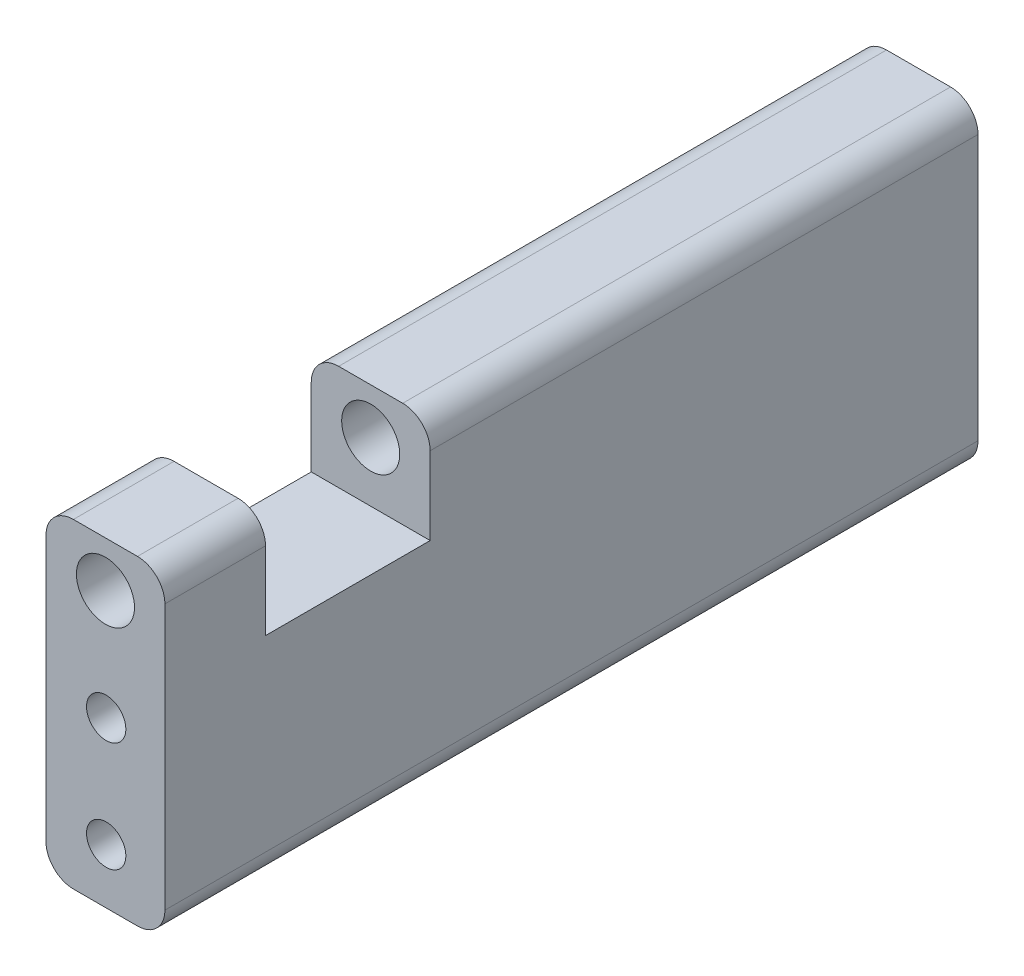
ISO-10303-21;
HEADER;
FILE_DESCRIPTION(('STEP AP214'),'2;1');
FILE_NAME('part.step','',(''),(''),'','','');
FILE_SCHEMA(('AUTOMOTIVE_DESIGN { 1 0 10303 214 1 1 1 1 }'));
ENDSEC;
DATA;
#1=APPLICATION_CONTEXT('core data for automotive mechanical design processes');
#2=APPLICATION_PROTOCOL_DEFINITION('international standard','automotive_design',2000,#1);
#3=PRODUCT_CONTEXT('',#1,'mechanical');
#4=PRODUCT('Part','Part','',(#3));
#5=PRODUCT_RELATED_PRODUCT_CATEGORY('part','',(#4));
#6=PRODUCT_DEFINITION_FORMATION('','',#4);
#7=PRODUCT_DEFINITION_CONTEXT('part definition',#1,'design');
#8=PRODUCT_DEFINITION('design','',#6,#7);
#9=PRODUCT_DEFINITION_SHAPE('','',#8);
#10=(LENGTH_UNIT() NAMED_UNIT(*) SI_UNIT(.MILLI.,.METRE.));
#11=(NAMED_UNIT(*) PLANE_ANGLE_UNIT() SI_UNIT($,.RADIAN.));
#12=(NAMED_UNIT(*) SI_UNIT($,.STERADIAN.) SOLID_ANGLE_UNIT());
#13=UNCERTAINTY_MEASURE_WITH_UNIT(LENGTH_MEASURE(1.E-05),#10,'distance_accuracy_value','');
#14=(GEOMETRIC_REPRESENTATION_CONTEXT(3) GLOBAL_UNCERTAINTY_ASSIGNED_CONTEXT((#13)) GLOBAL_UNIT_ASSIGNED_CONTEXT((#10,
#11,#12)) REPRESENTATION_CONTEXT('',''));
#15=CARTESIAN_POINT('',(0.,0.,0.));
#16=DIRECTION('',(0.,0.,1.));
#17=DIRECTION('',(1.,0.,0.));
#18=AXIS2_PLACEMENT_3D('',#15,#16,#17);
#19=CARTESIAN_POINT('',(0.,35.,88.9));
#20=DIRECTION('',(0.,-1.,0.));
#21=DIRECTION('',(0.,0.,-1.));
#22=AXIS2_PLACEMENT_3D('',#19,#20,#21);
#23=PLANE('',#22);
#24=DIRECTION('',(-1.,0.,0.));
#25=VECTOR('',#24,1.);
#26=CARTESIAN_POINT('',(0.,35.,77.9));
#27=LINE('',#26,#25);
#28=CARTESIAN_POINT('',(9.99999999999999,35.,77.9));
#29=VERTEX_POINT('',#28);
#30=CARTESIAN_POINT('',(3.,35.,77.9));
#31=VERTEX_POINT('',#30);
#32=EDGE_CURVE('E213',#29,#31,#27,.T.);
#33=ORIENTED_EDGE('',*,*,#32,.T.);
#34=DIRECTION('',(0.,0.,-1.));
#35=VECTOR('',#34,1.);
#36=CARTESIAN_POINT('',(3.,35.,88.9));
#37=LINE('',#36,#35);
#38=CARTESIAN_POINT('',(3.,35.,88.9));
#39=VERTEX_POINT('',#38);
#40=EDGE_CURVE('E338',#31,#39,#37,.F.);
#41=ORIENTED_EDGE('',*,*,#40,.T.);
#42=DIRECTION('',(-1.,0.,0.));
#43=VECTOR('',#42,1.);
#44=CARTESIAN_POINT('',(0.,35.,88.9));
#45=LINE('',#44,#43);
#46=CARTESIAN_POINT('',(9.99999999999999,35.,88.9));
#47=VERTEX_POINT('',#46);
#48=EDGE_CURVE('E254',#47,#39,#45,.T.);
#49=ORIENTED_EDGE('',*,*,#48,.F.);
#50=DIRECTION('',(0.,0.,-1.));
#51=VECTOR('',#50,1.);
#52=CARTESIAN_POINT('',(10.,35.,88.9));
#53=LINE('',#52,#51);
#54=EDGE_CURVE('E334',#47,#29,#53,.T.);
#55=ORIENTED_EDGE('',*,*,#54,.T.);
#56=EDGE_LOOP('',(#33,#41,#49,#55));
#57=FACE_BOUND('',#56,.T.);
#58=ADVANCED_FACE('F40',(#57),#23,.F.);
#59=CARTESIAN_POINT('',(6.5,30.,88.9));
#60=DIRECTION('',(0.,0.,-1.));
#61=DIRECTION('',(-1.,0.,0.));
#62=AXIS2_PLACEMENT_3D('',#59,#60,#61);
#63=CYLINDRICAL_SURFACE('',#62,3.175);
#64=CARTESIAN_POINT('',(6.5,30.,88.9));
#65=DIRECTION('',(0.,0.,1.));
#66=DIRECTION('',(1.,0.,0.));
#67=AXIS2_PLACEMENT_3D('',#64,#65,#66);
#68=CIRCLE('',#67,3.175);
#69=CARTESIAN_POINT('',(9.675,30.,88.9));
#70=VERTEX_POINT('',#69);
#71=EDGE_CURVE('E231',#70,#70,#68,.T.);
#72=ORIENTED_EDGE('',*,*,#71,.T.);
#73=EDGE_LOOP('',(#72));
#74=FACE_BOUND('',#73,.T.);
#75=CARTESIAN_POINT('',(6.5,30.,77.9));
#76=DIRECTION('',(0.,0.,-1.));
#77=DIRECTION('',(-1.,0.,0.));
#78=AXIS2_PLACEMENT_3D('',#75,#76,#77);
#79=CIRCLE('',#78,3.175);
#80=CARTESIAN_POINT('',(3.325,30.,77.9));
#81=VERTEX_POINT('',#80);
#82=EDGE_CURVE('E227',#81,#81,#79,.T.);
#83=ORIENTED_EDGE('',*,*,#82,.T.);
#84=EDGE_LOOP('',(#83));
#85=FACE_BOUND('',#84,.T.);
#86=ADVANCED_FACE('F383',(#74,#85),#63,.F.);
#87=CARTESIAN_POINT('',(0.,0.,88.9));
#88=DIRECTION('',(0.,0.,-1.));
#89=DIRECTION('',(-1.,0.,0.));
#90=AXIS2_PLACEMENT_3D('',#87,#88,#89);
#91=PLANE('',#90);
#92=CARTESIAN_POINT('',(6.57924630166814,18.,88.9));
#93=DIRECTION('',(0.,0.,1.));
#94=DIRECTION('',(1.,0.,0.));
#95=AXIS2_PLACEMENT_3D('',#92,#93,#94);
#96=CIRCLE('',#95,2.14999999999999);
#97=CARTESIAN_POINT('',(8.72924630166813,18.,88.9));
#98=VERTEX_POINT('',#97);
#99=EDGE_CURVE('E164',#98,#98,#96,.T.);
#100=ORIENTED_EDGE('',*,*,#99,.F.);
#101=EDGE_LOOP('',(#100));
#102=FACE_BOUND('',#101,.T.);
#103=CARTESIAN_POINT('',(6.57924630166814,6.,88.9));
#104=DIRECTION('',(0.,0.,1.));
#105=DIRECTION('',(1.,0.,0.));
#106=AXIS2_PLACEMENT_3D('',#103,#104,#105);
#107=CIRCLE('',#106,2.14999999999999);
#108=CARTESIAN_POINT('',(8.72924630166813,6.,88.9));
#109=VERTEX_POINT('',#108);
#110=EDGE_CURVE('E163',#109,#109,#107,.T.);
#111=ORIENTED_EDGE('',*,*,#110,.F.);
#112=EDGE_LOOP('',(#111));
#113=FACE_BOUND('',#112,.T.);
#114=DIRECTION('',(0.,-1.,0.));
#115=VECTOR('',#114,1.);
#116=CARTESIAN_POINT('',(0.,0.,88.9));
#117=LINE('',#116,#115);
#118=CARTESIAN_POINT('',(0.,32.,88.9));
#119=VERTEX_POINT('',#118);
#120=CARTESIAN_POINT('',(0.,3.,88.9));
#121=VERTEX_POINT('',#120);
#122=EDGE_CURVE('E241',#119,#121,#117,.T.);
#123=ORIENTED_EDGE('',*,*,#122,.T.);
#124=CARTESIAN_POINT('',(3.,3.,88.9));
#125=DIRECTION('',(0.,0.,-1.));
#126=DIRECTION('',(-1.,0.,0.));
#127=AXIS2_PLACEMENT_3D('',#124,#125,#126);
#128=CIRCLE('',#127,3.);
#129=CARTESIAN_POINT('',(3.,0.,88.9));
#130=VERTEX_POINT('',#129);
#131=EDGE_CURVE('E315',#121,#130,#128,.F.);
#132=ORIENTED_EDGE('',*,*,#131,.T.);
#133=DIRECTION('',(1.,0.,0.));
#134=VECTOR('',#133,1.);
#135=CARTESIAN_POINT('',(0.,0.,88.9));
#136=LINE('',#135,#134);
#137=CARTESIAN_POINT('',(9.99999999999999,0.,88.9));
#138=VERTEX_POINT('',#137);
#139=EDGE_CURVE('E245',#130,#138,#136,.T.);
#140=ORIENTED_EDGE('',*,*,#139,.T.);
#141=CARTESIAN_POINT('',(10.,3.,88.9));
#142=DIRECTION('',(0.,0.,-1.));
#143=DIRECTION('',(-1.,0.,0.));
#144=AXIS2_PLACEMENT_3D('',#141,#142,#143);
#145=CIRCLE('',#144,3.);
#146=CARTESIAN_POINT('',(13.,3.,88.9));
#147=VERTEX_POINT('',#146);
#148=EDGE_CURVE('E312',#138,#147,#145,.F.);
#149=ORIENTED_EDGE('',*,*,#148,.T.);
#150=DIRECTION('',(0.,1.,0.));
#151=VECTOR('',#150,1.);
#152=CARTESIAN_POINT('',(13.,0.,88.9));
#153=LINE('',#152,#151);
#154=CARTESIAN_POINT('',(13.,32.,88.9));
#155=VERTEX_POINT('',#154);
#156=EDGE_CURVE('E250',#147,#155,#153,.T.);
#157=ORIENTED_EDGE('',*,*,#156,.T.);
#158=CARTESIAN_POINT('',(10.,32.,88.9));
#159=DIRECTION('',(0.,0.,-1.));
#160=DIRECTION('',(-1.,0.,0.));
#161=AXIS2_PLACEMENT_3D('',#158,#159,#160);
#162=CIRCLE('',#161,3.);
#163=EDGE_CURVE('E306',#155,#47,#162,.F.);
#164=ORIENTED_EDGE('',*,*,#163,.T.);
#165=ORIENTED_EDGE('',*,*,#48,.T.);
#166=CARTESIAN_POINT('',(3.,32.,88.9));
#167=DIRECTION('',(0.,0.,-1.));
#168=DIRECTION('',(-1.,0.,0.));
#169=AXIS2_PLACEMENT_3D('',#166,#167,#168);
#170=CIRCLE('',#169,3.);
#171=EDGE_CURVE('E309',#39,#119,#170,.F.);
#172=ORIENTED_EDGE('',*,*,#171,.T.);
#173=EDGE_LOOP('',(#123,#132,#140,#149,#157,#164,#165,#172));
#174=FACE_BOUND('',#173,.T.);
#175=ORIENTED_EDGE('',*,*,#71,.F.);
#176=EDGE_LOOP('',(#175));
#177=FACE_BOUND('',#176,.T.);
#178=ADVANCED_FACE('F389',(#102,#113,#174,#177),#91,.F.);
#179=CARTESIAN_POINT('',(0.,0.,0.));
#180=DIRECTION('',(0.,0.,-1.));
#181=DIRECTION('',(-1.,0.,0.));
#182=AXIS2_PLACEMENT_3D('',#179,#180,#181);
#183=PLANE('',#182);
#184=CARTESIAN_POINT('',(6.57924630166814,18.,0.));
#185=DIRECTION('',(0.,0.,-1.));
#186=DIRECTION('',(-1.,0.,0.));
#187=AXIS2_PLACEMENT_3D('',#184,#185,#186);
#188=CIRCLE('',#187,2.14999999999999);
#189=CARTESIAN_POINT('',(4.42924630166815,18.,0.));
#190=VERTEX_POINT('',#189);
#191=EDGE_CURVE('E179',#190,#190,#188,.T.);
#192=ORIENTED_EDGE('',*,*,#191,.F.);
#193=EDGE_LOOP('',(#192));
#194=FACE_BOUND('',#193,.T.);
#195=CARTESIAN_POINT('',(6.57924630166814,6.,0.));
#196=DIRECTION('',(0.,0.,-1.));
#197=DIRECTION('',(-1.,0.,0.));
#198=AXIS2_PLACEMENT_3D('',#195,#196,#197);
#199=CIRCLE('',#198,2.14999999999999);
#200=CARTESIAN_POINT('',(4.42924630166815,6.,0.));
#201=VERTEX_POINT('',#200);
#202=EDGE_CURVE('E186',#201,#201,#199,.T.);
#203=ORIENTED_EDGE('',*,*,#202,.F.);
#204=EDGE_LOOP('',(#203));
#205=FACE_BOUND('',#204,.T.);
#206=DIRECTION('',(1.,0.,0.));
#207=VECTOR('',#206,1.);
#208=CARTESIAN_POINT('',(0.,0.,0.));
#209=LINE('',#208,#207);
#210=CARTESIAN_POINT('',(3.,0.,0.));
#211=VERTEX_POINT('',#210);
#212=CARTESIAN_POINT('',(9.99999999999999,0.,0.));
#213=VERTEX_POINT('',#212);
#214=EDGE_CURVE('E262',#211,#213,#209,.T.);
#215=ORIENTED_EDGE('',*,*,#214,.F.);
#216=CARTESIAN_POINT('',(3.,3.,0.));
#217=DIRECTION('',(0.,0.,-1.));
#218=DIRECTION('',(-1.,0.,0.));
#219=AXIS2_PLACEMENT_3D('',#216,#217,#218);
#220=CIRCLE('',#219,3.);
#221=CARTESIAN_POINT('',(0.,3.,0.));
#222=VERTEX_POINT('',#221);
#223=EDGE_CURVE('E293',#211,#222,#220,.T.);
#224=ORIENTED_EDGE('',*,*,#223,.T.);
#225=DIRECTION('',(0.,-1.,0.));
#226=VECTOR('',#225,1.);
#227=CARTESIAN_POINT('',(0.,0.,0.));
#228=LINE('',#227,#226);
#229=CARTESIAN_POINT('',(0.,32.,0.));
#230=VERTEX_POINT('',#229);
#231=EDGE_CURVE('E235',#230,#222,#228,.T.);
#232=ORIENTED_EDGE('',*,*,#231,.F.);
#233=CARTESIAN_POINT('',(3.,32.,0.));
#234=DIRECTION('',(0.,0.,-1.));
#235=DIRECTION('',(-1.,0.,0.));
#236=AXIS2_PLACEMENT_3D('',#233,#234,#235);
#237=CIRCLE('',#236,3.);
#238=CARTESIAN_POINT('',(3.,35.,0.));
#239=VERTEX_POINT('',#238);
#240=EDGE_CURVE('E287',#230,#239,#237,.T.);
#241=ORIENTED_EDGE('',*,*,#240,.T.);
#242=DIRECTION('',(-1.,0.,0.));
#243=VECTOR('',#242,1.);
#244=CARTESIAN_POINT('',(0.,35.,0.));
#245=LINE('',#244,#243);
#246=CARTESIAN_POINT('',(9.99999999999999,35.,0.));
#247=VERTEX_POINT('',#246);
#248=EDGE_CURVE('E246',#247,#239,#245,.T.);
#249=ORIENTED_EDGE('',*,*,#248,.F.);
#250=CARTESIAN_POINT('',(10.,32.,0.));
#251=DIRECTION('',(0.,0.,-1.));
#252=DIRECTION('',(-1.,0.,0.));
#253=AXIS2_PLACEMENT_3D('',#250,#251,#252);
#254=CIRCLE('',#253,3.);
#255=CARTESIAN_POINT('',(13.,32.,0.));
#256=VERTEX_POINT('',#255);
#257=EDGE_CURVE('E284',#247,#256,#254,.T.);
#258=ORIENTED_EDGE('',*,*,#257,.T.);
#259=DIRECTION('',(0.,1.,0.));
#260=VECTOR('',#259,1.);
#261=CARTESIAN_POINT('',(13.,0.,0.));
#262=LINE('',#261,#260);
#263=CARTESIAN_POINT('',(13.,3.,0.));
#264=VERTEX_POINT('',#263);
#265=EDGE_CURVE('E266',#264,#256,#262,.T.);
#266=ORIENTED_EDGE('',*,*,#265,.F.);
#267=CARTESIAN_POINT('',(10.,3.,0.));
#268=DIRECTION('',(0.,0.,-1.));
#269=DIRECTION('',(-1.,0.,0.));
#270=AXIS2_PLACEMENT_3D('',#267,#268,#269);
#271=CIRCLE('',#270,3.);
#272=EDGE_CURVE('E290',#264,#213,#271,.T.);
#273=ORIENTED_EDGE('',*,*,#272,.T.);
#274=EDGE_LOOP('',(#215,#224,#232,#241,#249,#258,#266,#273));
#275=FACE_BOUND('',#274,.T.);
#276=CARTESIAN_POINT('',(6.5,30.,0.));
#277=DIRECTION('',(0.,0.,1.));
#278=DIRECTION('',(1.,0.,0.));
#279=AXIS2_PLACEMENT_3D('',#276,#277,#278);
#280=CIRCLE('',#279,3.175);
#281=CARTESIAN_POINT('',(9.675,30.,0.));
#282=VERTEX_POINT('',#281);
#283=EDGE_CURVE('E236',#282,#282,#280,.T.);
#284=ORIENTED_EDGE('',*,*,#283,.T.);
#285=EDGE_LOOP('',(#284));
#286=FACE_BOUND('',#285,.T.);
#287=ADVANCED_FACE('F353',(#194,#205,#275,#286),#183,.T.);
#288=CARTESIAN_POINT('',(0.,0.,88.9));
#289=DIRECTION('',(1.,0.,0.));
#290=DIRECTION('',(0.,0.,-1.));
#291=AXIS2_PLACEMENT_3D('',#288,#289,#290);
#292=PLANE('',#291);
#293=ORIENTED_EDGE('',*,*,#231,.T.);
#294=DIRECTION('',(0.,0.,-1.));
#295=VECTOR('',#294,1.);
#296=CARTESIAN_POINT('',(0.,3.,88.9));
#297=LINE('',#296,#295);
#298=EDGE_CURVE('E303',#222,#121,#297,.F.);
#299=ORIENTED_EDGE('',*,*,#298,.T.);
#300=ORIENTED_EDGE('',*,*,#122,.F.);
#301=DIRECTION('',(0.,0.,-1.));
#302=VECTOR('',#301,1.);
#303=CARTESIAN_POINT('',(0.,32.,88.9));
#304=LINE('',#303,#302);
#305=CARTESIAN_POINT('',(0.,32.,77.9));
#306=VERTEX_POINT('',#305);
#307=EDGE_CURVE('E300',#119,#306,#304,.T.);
#308=ORIENTED_EDGE('',*,*,#307,.T.);
#309=DIRECTION('',(0.,-1.,0.));
#310=VECTOR('',#309,1.);
#311=CARTESIAN_POINT('',(0.,30.,77.9));
#312=LINE('',#311,#310);
#313=CARTESIAN_POINT('',(0.,23.5,77.9));
#314=VERTEX_POINT('',#313);
#315=EDGE_CURVE('E217',#306,#314,#312,.T.);
#316=ORIENTED_EDGE('',*,*,#315,.T.);
#317=DIRECTION('',(0.,0.,1.));
#318=VECTOR('',#317,1.);
#319=CARTESIAN_POINT('',(0.,23.5,59.9));
#320=LINE('',#319,#318);
#321=CARTESIAN_POINT('',(0.,23.5,59.9));
#322=VERTEX_POINT('',#321);
#323=EDGE_CURVE('E209',#322,#314,#320,.T.);
#324=ORIENTED_EDGE('',*,*,#323,.F.);
#325=DIRECTION('',(0.,-1.,0.));
#326=VECTOR('',#325,1.);
#327=CARTESIAN_POINT('',(0.,30.,59.9));
#328=LINE('',#327,#326);
#329=CARTESIAN_POINT('',(0.,32.,59.9));
#330=VERTEX_POINT('',#329);
#331=EDGE_CURVE('E202',#330,#322,#328,.T.);
#332=ORIENTED_EDGE('',*,*,#331,.F.);
#333=DIRECTION('',(0.,0.,-1.));
#334=VECTOR('',#333,1.);
#335=CARTESIAN_POINT('',(0.,32.,88.9));
#336=LINE('',#335,#334);
#337=EDGE_CURVE('E296',#330,#230,#336,.T.);
#338=ORIENTED_EDGE('',*,*,#337,.T.);
#339=EDGE_LOOP('',(#293,#299,#300,#308,#316,#324,#332,#338));
#340=FACE_BOUND('',#339,.T.);
#341=ADVANCED_FACE('F363',(#340),#292,.F.);
#342=CARTESIAN_POINT('',(0.,0.,88.9));
#343=DIRECTION('',(0.,1.,0.));
#344=DIRECTION('',(0.,0.,1.));
#345=AXIS2_PLACEMENT_3D('',#342,#343,#344);
#346=PLANE('',#345);
#347=ORIENTED_EDGE('',*,*,#139,.F.);
#348=DIRECTION('',(0.,0.,-1.));
#349=VECTOR('',#348,1.);
#350=CARTESIAN_POINT('',(3.,0.,88.9));
#351=LINE('',#350,#349);
#352=EDGE_CURVE('E280',#130,#211,#351,.T.);
#353=ORIENTED_EDGE('',*,*,#352,.T.);
#354=ORIENTED_EDGE('',*,*,#214,.T.);
#355=DIRECTION('',(0.,0.,-1.));
#356=VECTOR('',#355,1.);
#357=CARTESIAN_POINT('',(10.,0.,88.9));
#358=LINE('',#357,#356);
#359=EDGE_CURVE('E258',#213,#138,#358,.F.);
#360=ORIENTED_EDGE('',*,*,#359,.T.);
#361=EDGE_LOOP('',(#347,#353,#354,#360));
#362=FACE_BOUND('',#361,.T.);
#363=ADVANCED_FACE('F401',(#362),#346,.F.);
#364=CARTESIAN_POINT('',(13.,0.,88.9));
#365=DIRECTION('',(-1.,0.,0.));
#366=DIRECTION('',(0.,0.,1.));
#367=AXIS2_PLACEMENT_3D('',#364,#365,#366);
#368=PLANE('',#367);
#369=ORIENTED_EDGE('',*,*,#156,.F.);
#370=DIRECTION('',(0.,0.,-1.));
#371=VECTOR('',#370,1.);
#372=CARTESIAN_POINT('',(13.,3.,88.9));
#373=LINE('',#372,#371);
#374=EDGE_CURVE('E324',#147,#264,#373,.T.);
#375=ORIENTED_EDGE('',*,*,#374,.T.);
#376=ORIENTED_EDGE('',*,*,#265,.T.);
#377=DIRECTION('',(0.,0.,-1.));
#378=VECTOR('',#377,1.);
#379=CARTESIAN_POINT('',(13.,32.,88.9));
#380=LINE('',#379,#378);
#381=CARTESIAN_POINT('',(13.,32.,59.9));
#382=VERTEX_POINT('',#381);
#383=EDGE_CURVE('E318',#256,#382,#380,.F.);
#384=ORIENTED_EDGE('',*,*,#383,.T.);
#385=DIRECTION('',(0.,1.,0.));
#386=VECTOR('',#385,1.);
#387=CARTESIAN_POINT('',(13.,23.5,59.9));
#388=LINE('',#387,#386);
#389=CARTESIAN_POINT('',(13.,23.5,59.9));
#390=VERTEX_POINT('',#389);
#391=EDGE_CURVE('E195',#390,#382,#388,.T.);
#392=ORIENTED_EDGE('',*,*,#391,.F.);
#393=DIRECTION('',(0.,0.,1.));
#394=VECTOR('',#393,1.);
#395=CARTESIAN_POINT('',(13.,23.5,59.9));
#396=LINE('',#395,#394);
#397=CARTESIAN_POINT('',(13.,23.5,77.9));
#398=VERTEX_POINT('',#397);
#399=EDGE_CURVE('E223',#390,#398,#396,.T.);
#400=ORIENTED_EDGE('',*,*,#399,.T.);
#401=DIRECTION('',(0.,1.,0.));
#402=VECTOR('',#401,1.);
#403=CARTESIAN_POINT('',(13.,35.,77.9));
#404=LINE('',#403,#402);
#405=CARTESIAN_POINT('',(13.,32.,77.9));
#406=VERTEX_POINT('',#405);
#407=EDGE_CURVE('E194',#398,#406,#404,.T.);
#408=ORIENTED_EDGE('',*,*,#407,.T.);
#409=DIRECTION('',(0.,0.,-1.));
#410=VECTOR('',#409,1.);
#411=CARTESIAN_POINT('',(13.,32.,88.9));
#412=LINE('',#411,#410);
#413=EDGE_CURVE('E321',#406,#155,#412,.F.);
#414=ORIENTED_EDGE('',*,*,#413,.T.);
#415=EDGE_LOOP('',(#369,#375,#376,#384,#392,#400,#408,#414));
#416=FACE_BOUND('',#415,.T.);
#417=ADVANCED_FACE('F374',(#416),#368,.F.);
#418=ORIENTED_EDGE('',*,*,#248,.T.);
#419=DIRECTION('',(0.,0.,-1.));
#420=VECTOR('',#419,1.);
#421=CARTESIAN_POINT('',(3.,35.,88.9));
#422=LINE('',#421,#420);
#423=CARTESIAN_POINT('',(3.,35.,59.9));
#424=VERTEX_POINT('',#423);
#425=EDGE_CURVE('E56',#239,#424,#422,.F.);
#426=ORIENTED_EDGE('',*,*,#425,.T.);
#427=DIRECTION('',(-1.,0.,0.));
#428=VECTOR('',#427,1.);
#429=CARTESIAN_POINT('',(0.,35.,59.9));
#430=LINE('',#429,#428);
#431=CARTESIAN_POINT('',(9.99999999999999,35.,59.9));
#432=VERTEX_POINT('',#431);
#433=EDGE_CURVE('E198',#432,#424,#430,.T.);
#434=ORIENTED_EDGE('',*,*,#433,.F.);
#435=DIRECTION('',(0.,0.,-1.));
#436=VECTOR('',#435,1.);
#437=CARTESIAN_POINT('',(10.,35.,88.9));
#438=LINE('',#437,#436);
#439=EDGE_CURVE('E341',#432,#247,#438,.T.);
#440=ORIENTED_EDGE('',*,*,#439,.T.);
#441=EDGE_LOOP('',(#418,#426,#434,#440));
#442=FACE_BOUND('',#441,.T.);
#443=ADVANCED_FACE('F349',(#442),#23,.F.);
#444=CARTESIAN_POINT('',(6.5,30.,59.9));
#445=DIRECTION('',(0.,0.,-1.));
#446=DIRECTION('',(-1.,0.,0.));
#447=AXIS2_PLACEMENT_3D('',#444,#445,#446);
#448=CIRCLE('',#447,3.175);
#449=CARTESIAN_POINT('',(3.325,30.,59.9));
#450=VERTEX_POINT('',#449);
#451=EDGE_CURVE('E240',#450,#450,#448,.T.);
#452=ORIENTED_EDGE('',*,*,#451,.F.);
#453=EDGE_LOOP('',(#452));
#454=FACE_BOUND('',#453,.T.);
#455=ORIENTED_EDGE('',*,*,#283,.F.);
#456=EDGE_LOOP('',(#455));
#457=FACE_BOUND('',#456,.T.);
#458=ADVANCED_FACE('F392',(#454,#457),#63,.F.);
#459=CARTESIAN_POINT('',(0.,23.5,59.9));
#460=DIRECTION('',(0.,-1.,0.));
#461=DIRECTION('',(0.,0.,-1.));
#462=AXIS2_PLACEMENT_3D('',#459,#460,#461);
#463=PLANE('',#462);
#464=DIRECTION('',(1.,0.,0.));
#465=VECTOR('',#464,1.);
#466=CARTESIAN_POINT('',(0.,23.5,77.9));
#467=LINE('',#466,#465);
#468=EDGE_CURVE('E199',#314,#398,#467,.T.);
#469=ORIENTED_EDGE('',*,*,#468,.T.);
#470=ORIENTED_EDGE('',*,*,#399,.F.);
#471=DIRECTION('',(1.,0.,0.));
#472=VECTOR('',#471,1.);
#473=CARTESIAN_POINT('',(0.,23.5,59.9));
#474=LINE('',#473,#472);
#475=EDGE_CURVE('E205',#322,#390,#474,.T.);
#476=ORIENTED_EDGE('',*,*,#475,.F.);
#477=ORIENTED_EDGE('',*,*,#323,.T.);
#478=EDGE_LOOP('',(#469,#470,#476,#477));
#479=FACE_BOUND('',#478,.T.);
#480=ADVANCED_FACE('F370',(#479),#463,.F.);
#481=CARTESIAN_POINT('',(0.,0.,59.9));
#482=DIRECTION('',(0.,0.,-1.));
#483=DIRECTION('',(-1.,0.,0.));
#484=AXIS2_PLACEMENT_3D('',#481,#482,#483);
#485=PLANE('',#484);
#486=ORIENTED_EDGE('',*,*,#451,.T.);
#487=EDGE_LOOP('',(#486));
#488=FACE_BOUND('',#487,.T.);
#489=ORIENTED_EDGE('',*,*,#433,.T.);
#490=CARTESIAN_POINT('',(3.,32.,59.9));
#491=DIRECTION('',(0.,0.,-1.));
#492=DIRECTION('',(-1.,0.,0.));
#493=AXIS2_PLACEMENT_3D('',#490,#491,#492);
#494=CIRCLE('',#493,3.);
#495=EDGE_CURVE('E11',#424,#330,#494,.F.);
#496=ORIENTED_EDGE('',*,*,#495,.T.);
#497=ORIENTED_EDGE('',*,*,#331,.T.);
#498=ORIENTED_EDGE('',*,*,#475,.T.);
#499=ORIENTED_EDGE('',*,*,#391,.T.);
#500=CARTESIAN_POINT('',(10.,32.,59.9));
#501=DIRECTION('',(0.,0.,-1.));
#502=DIRECTION('',(-1.,0.,0.));
#503=AXIS2_PLACEMENT_3D('',#500,#501,#502);
#504=CIRCLE('',#503,3.);
#505=EDGE_CURVE('E49',#382,#432,#504,.F.);
#506=ORIENTED_EDGE('',*,*,#505,.T.);
#507=EDGE_LOOP('',(#489,#496,#497,#498,#499,#506));
#508=FACE_BOUND('',#507,.T.);
#509=ADVANCED_FACE('F367',(#488,#508),#485,.F.);
#510=CARTESIAN_POINT('',(0.,0.,77.9));
#511=DIRECTION('',(0.,0.,-1.));
#512=DIRECTION('',(-1.,0.,0.));
#513=AXIS2_PLACEMENT_3D('',#510,#511,#512);
#514=PLANE('',#513);
#515=ORIENTED_EDGE('',*,*,#82,.F.);
#516=EDGE_LOOP('',(#515));
#517=FACE_BOUND('',#516,.T.);
#518=ORIENTED_EDGE('',*,*,#315,.F.);
#519=CARTESIAN_POINT('',(3.,32.,77.9));
#520=DIRECTION('',(0.,0.,-1.));
#521=DIRECTION('',(-1.,0.,0.));
#522=AXIS2_PLACEMENT_3D('',#519,#520,#521);
#523=CIRCLE('',#522,3.);
#524=EDGE_CURVE('E331',#306,#31,#523,.T.);
#525=ORIENTED_EDGE('',*,*,#524,.T.);
#526=ORIENTED_EDGE('',*,*,#32,.F.);
#527=CARTESIAN_POINT('',(10.,32.,77.9));
#528=DIRECTION('',(0.,0.,-1.));
#529=DIRECTION('',(-1.,0.,0.));
#530=AXIS2_PLACEMENT_3D('',#527,#528,#529);
#531=CIRCLE('',#530,3.);
#532=EDGE_CURVE('E328',#29,#406,#531,.T.);
#533=ORIENTED_EDGE('',*,*,#532,.T.);
#534=ORIENTED_EDGE('',*,*,#407,.F.);
#535=ORIENTED_EDGE('',*,*,#468,.F.);
#536=EDGE_LOOP('',(#518,#525,#526,#533,#534,#535));
#537=FACE_BOUND('',#536,.T.);
#538=ADVANCED_FACE('F444',(#517,#537),#514,.T.);
#539=CARTESIAN_POINT('',(6.57924630166814,6.,5.));
#540=DIRECTION('',(0.,0.,-1.));
#541=DIRECTION('',(-1.,0.,0.));
#542=AXIS2_PLACEMENT_3D('',#539,#540,#541);
#543=CONICAL_SURFACE('',#542,2.14999999999999,1.02974425867665);
#544=CARTESIAN_POINT('',(6.57924630166814,6.,6.29185033090925));
#545=VERTEX_POINT('',#544);
#546=VERTEX_LOOP('',#545);
#547=FACE_BOUND('',#546,.T.);
#548=CARTESIAN_POINT('',(6.57924630166814,6.,5.));
#549=DIRECTION('',(0.,0.,-1.));
#550=DIRECTION('',(-1.,0.,0.));
#551=AXIS2_PLACEMENT_3D('',#548,#549,#550);
#552=CIRCLE('',#551,2.14999999999999);
#553=CARTESIAN_POINT('',(4.42924630166815,6.,5.));
#554=VERTEX_POINT('',#553);
#555=EDGE_CURVE('E190',#554,#554,#552,.T.);
#556=ORIENTED_EDGE('',*,*,#555,.T.);
#557=EDGE_LOOP('',(#556));
#558=FACE_BOUND('',#557,.T.);
#559=ADVANCED_FACE('F446',(#547,#558),#543,.F.);
#560=CARTESIAN_POINT('',(6.57924630166814,6.,0.));
#561=DIRECTION('',(0.,0.,-1.));
#562=DIRECTION('',(-1.,0.,0.));
#563=AXIS2_PLACEMENT_3D('',#560,#561,#562);
#564=CYLINDRICAL_SURFACE('',#563,2.14999999999999);
#565=ORIENTED_EDGE('',*,*,#555,.F.);
#566=EDGE_LOOP('',(#565));
#567=FACE_BOUND('',#566,.T.);
#568=ORIENTED_EDGE('',*,*,#202,.T.);
#569=EDGE_LOOP('',(#568));
#570=FACE_BOUND('',#569,.T.);
#571=ADVANCED_FACE('F453',(#567,#570),#564,.F.);
#572=CARTESIAN_POINT('',(6.57924630166814,18.,5.));
#573=DIRECTION('',(0.,0.,-1.));
#574=DIRECTION('',(-1.,0.,0.));
#575=AXIS2_PLACEMENT_3D('',#572,#573,#574);
#576=CONICAL_SURFACE('',#575,2.14999999999999,1.02974425867665);
#577=CARTESIAN_POINT('',(6.57924630166814,18.,6.29185033090925));
#578=VERTEX_POINT('',#577);
#579=VERTEX_LOOP('',#578);
#580=FACE_BOUND('',#579,.T.);
#581=CARTESIAN_POINT('',(6.57924630166814,18.,5.));
#582=DIRECTION('',(0.,0.,-1.));
#583=DIRECTION('',(-1.,0.,0.));
#584=AXIS2_PLACEMENT_3D('',#581,#582,#583);
#585=CIRCLE('',#584,2.14999999999999);
#586=CARTESIAN_POINT('',(4.42924630166815,18.,5.));
#587=VERTEX_POINT('',#586);
#588=EDGE_CURVE('E183',#587,#587,#585,.T.);
#589=ORIENTED_EDGE('',*,*,#588,.T.);
#590=EDGE_LOOP('',(#589));
#591=FACE_BOUND('',#590,.T.);
#592=ADVANCED_FACE('F473',(#580,#591),#576,.F.);
#593=CARTESIAN_POINT('',(6.57924630166814,18.,0.));
#594=DIRECTION('',(0.,0.,-1.));
#595=DIRECTION('',(-1.,0.,0.));
#596=AXIS2_PLACEMENT_3D('',#593,#594,#595);
#597=CYLINDRICAL_SURFACE('',#596,2.14999999999999);
#598=ORIENTED_EDGE('',*,*,#588,.F.);
#599=EDGE_LOOP('',(#598));
#600=FACE_BOUND('',#599,.T.);
#601=ORIENTED_EDGE('',*,*,#191,.T.);
#602=EDGE_LOOP('',(#601));
#603=FACE_BOUND('',#602,.T.);
#604=ADVANCED_FACE('F479',(#600,#603),#597,.F.);
#605=CARTESIAN_POINT('',(6.57924630166814,6.,83.9));
#606=DIRECTION('',(0.,0.,1.));
#607=DIRECTION('',(1.,0.,0.));
#608=AXIS2_PLACEMENT_3D('',#605,#606,#607);
#609=CONICAL_SURFACE('',#608,2.14999999999999,1.02974425867665);
#610=CARTESIAN_POINT('',(6.57924630166814,6.,82.6081496690907));
#611=VERTEX_POINT('',#610);
#612=VERTEX_LOOP('',#611);
#613=FACE_BOUND('',#612,.T.);
#614=CARTESIAN_POINT('',(6.57924630166814,6.,83.9));
#615=DIRECTION('',(0.,0.,1.));
#616=DIRECTION('',(1.,0.,0.));
#617=AXIS2_PLACEMENT_3D('',#614,#615,#616);
#618=CIRCLE('',#617,2.14999999999999);
#619=CARTESIAN_POINT('',(8.72924630166813,6.,83.9));
#620=VERTEX_POINT('',#619);
#621=EDGE_CURVE('E170',#620,#620,#618,.T.);
#622=ORIENTED_EDGE('',*,*,#621,.T.);
#623=EDGE_LOOP('',(#622));
#624=FACE_BOUND('',#623,.T.);
#625=ADVANCED_FACE('F486',(#613,#624),#609,.F.);
#626=CARTESIAN_POINT('',(6.57924630166814,6.,88.9));
#627=DIRECTION('',(0.,0.,1.));
#628=DIRECTION('',(1.,0.,0.));
#629=AXIS2_PLACEMENT_3D('',#626,#627,#628);
#630=CYLINDRICAL_SURFACE('',#629,2.14999999999999);
#631=ORIENTED_EDGE('',*,*,#621,.F.);
#632=EDGE_LOOP('',(#631));
#633=FACE_BOUND('',#632,.T.);
#634=ORIENTED_EDGE('',*,*,#110,.T.);
#635=EDGE_LOOP('',(#634));
#636=FACE_BOUND('',#635,.T.);
#637=ADVANCED_FACE('F156',(#633,#636),#630,.F.);
#638=CARTESIAN_POINT('',(6.57924630166814,18.,83.9));
#639=DIRECTION('',(0.,0.,1.));
#640=DIRECTION('',(1.,0.,0.));
#641=AXIS2_PLACEMENT_3D('',#638,#639,#640);
#642=CONICAL_SURFACE('',#641,2.14999999999999,1.02974425867665);
#643=CARTESIAN_POINT('',(6.57924630166814,18.,82.6081496690907));
#644=VERTEX_POINT('',#643);
#645=VERTEX_LOOP('',#644);
#646=FACE_BOUND('',#645,.T.);
#647=CARTESIAN_POINT('',(6.57924630166814,18.,83.9));
#648=DIRECTION('',(0.,0.,1.));
#649=DIRECTION('',(1.,0.,0.));
#650=AXIS2_PLACEMENT_3D('',#647,#648,#649);
#651=CIRCLE('',#650,2.14999999999999);
#652=CARTESIAN_POINT('',(8.72924630166813,18.,83.9));
#653=VERTEX_POINT('',#652);
#654=EDGE_CURVE('E160',#653,#653,#651,.T.);
#655=ORIENTED_EDGE('',*,*,#654,.T.);
#656=EDGE_LOOP('',(#655));
#657=FACE_BOUND('',#656,.T.);
#658=ADVANCED_FACE('F152',(#646,#657),#642,.F.);
#659=CARTESIAN_POINT('',(6.57924630166814,18.,88.9));
#660=DIRECTION('',(0.,0.,1.));
#661=DIRECTION('',(1.,0.,0.));
#662=AXIS2_PLACEMENT_3D('',#659,#660,#661);
#663=CYLINDRICAL_SURFACE('',#662,2.14999999999999);
#664=ORIENTED_EDGE('',*,*,#654,.F.);
#665=EDGE_LOOP('',(#664));
#666=FACE_BOUND('',#665,.T.);
#667=ORIENTED_EDGE('',*,*,#99,.T.);
#668=EDGE_LOOP('',(#667));
#669=FACE_BOUND('',#668,.T.);
#670=ADVANCED_FACE('F155',(#666,#669),#663,.F.);
#671=CARTESIAN_POINT('',(3.,3.,88.9));
#672=DIRECTION('',(0.,0.,-1.));
#673=DIRECTION('',(-1.,0.,0.));
#674=AXIS2_PLACEMENT_3D('',#671,#672,#673);
#675=CYLINDRICAL_SURFACE('',#674,3.);
#676=ORIENTED_EDGE('',*,*,#131,.F.);
#677=ORIENTED_EDGE('',*,*,#298,.F.);
#678=ORIENTED_EDGE('',*,*,#223,.F.);
#679=ORIENTED_EDGE('',*,*,#352,.F.);
#680=EDGE_LOOP('',(#676,#677,#678,#679));
#681=FACE_BOUND('',#680,.T.);
#682=ADVANCED_FACE('F410',(#681),#675,.T.);
#683=CARTESIAN_POINT('',(10.,3.,88.9));
#684=DIRECTION('',(0.,0.,-1.));
#685=DIRECTION('',(-1.,0.,0.));
#686=AXIS2_PLACEMENT_3D('',#683,#684,#685);
#687=CYLINDRICAL_SURFACE('',#686,3.);
#688=ORIENTED_EDGE('',*,*,#148,.F.);
#689=ORIENTED_EDGE('',*,*,#359,.F.);
#690=ORIENTED_EDGE('',*,*,#272,.F.);
#691=ORIENTED_EDGE('',*,*,#374,.F.);
#692=EDGE_LOOP('',(#688,#689,#690,#691));
#693=FACE_BOUND('',#692,.T.);
#694=ADVANCED_FACE('F413',(#693),#687,.T.);
#695=CARTESIAN_POINT('',(3.,32.,88.9));
#696=DIRECTION('',(0.,0.,-1.));
#697=DIRECTION('',(-1.,0.,0.));
#698=AXIS2_PLACEMENT_3D('',#695,#696,#697);
#699=CYLINDRICAL_SURFACE('',#698,3.);
#700=ORIENTED_EDGE('',*,*,#171,.F.);
#701=ORIENTED_EDGE('',*,*,#40,.F.);
#702=ORIENTED_EDGE('',*,*,#524,.F.);
#703=ORIENTED_EDGE('',*,*,#307,.F.);
#704=EDGE_LOOP('',(#700,#701,#702,#703));
#705=FACE_BOUND('',#704,.T.);
#706=ADVANCED_FACE('F417',(#705),#699,.T.);
#707=CARTESIAN_POINT('',(10.,32.,88.9));
#708=DIRECTION('',(0.,0.,-1.));
#709=DIRECTION('',(-1.,0.,0.));
#710=AXIS2_PLACEMENT_3D('',#707,#708,#709);
#711=CYLINDRICAL_SURFACE('',#710,3.);
#712=ORIENTED_EDGE('',*,*,#163,.F.);
#713=ORIENTED_EDGE('',*,*,#413,.F.);
#714=ORIENTED_EDGE('',*,*,#532,.F.);
#715=ORIENTED_EDGE('',*,*,#54,.F.);
#716=EDGE_LOOP('',(#712,#713,#714,#715));
#717=FACE_BOUND('',#716,.T.);
#718=ADVANCED_FACE('F381',(#717),#711,.T.);
#719=CARTESIAN_POINT('',(3.,32.,88.9));
#720=DIRECTION('',(0.,0.,-1.));
#721=DIRECTION('',(-1.,0.,0.));
#722=AXIS2_PLACEMENT_3D('',#719,#720,#721);
#723=CYLINDRICAL_SURFACE('',#722,3.);
#724=ORIENTED_EDGE('',*,*,#495,.F.);
#725=ORIENTED_EDGE('',*,*,#425,.F.);
#726=ORIENTED_EDGE('',*,*,#240,.F.);
#727=ORIENTED_EDGE('',*,*,#337,.F.);
#728=EDGE_LOOP('',(#724,#725,#726,#727));
#729=FACE_BOUND('',#728,.T.);
#730=ADVANCED_FACE('F360',(#729),#723,.T.);
#731=CARTESIAN_POINT('',(10.,32.,88.9));
#732=DIRECTION('',(0.,0.,-1.));
#733=DIRECTION('',(-1.,0.,0.));
#734=AXIS2_PLACEMENT_3D('',#731,#732,#733);
#735=CYLINDRICAL_SURFACE('',#734,3.);
#736=ORIENTED_EDGE('',*,*,#505,.F.);
#737=ORIENTED_EDGE('',*,*,#383,.F.);
#738=ORIENTED_EDGE('',*,*,#257,.F.);
#739=ORIENTED_EDGE('',*,*,#439,.F.);
#740=EDGE_LOOP('',(#736,#737,#738,#739));
#741=FACE_BOUND('',#740,.T.);
#742=ADVANCED_FACE('F42',(#741),#735,.T.);
#743=CLOSED_SHELL('',(#58,#86,#178,#287,#341,#363,#417,#443,#458,#480,#509,#538,#559,#571,#592,
#604,#625,#637,#658,#670,#682,#694,#706,#718,#730,#742));
#744=MANIFOLD_SOLID_BREP('B2',#743);
#745=ADVANCED_BREP_SHAPE_REPRESENTATION('',(#18,#744),#14);
#746=SHAPE_DEFINITION_REPRESENTATION(#9,#745);
ENDSEC;
END-ISO-10303-21;
